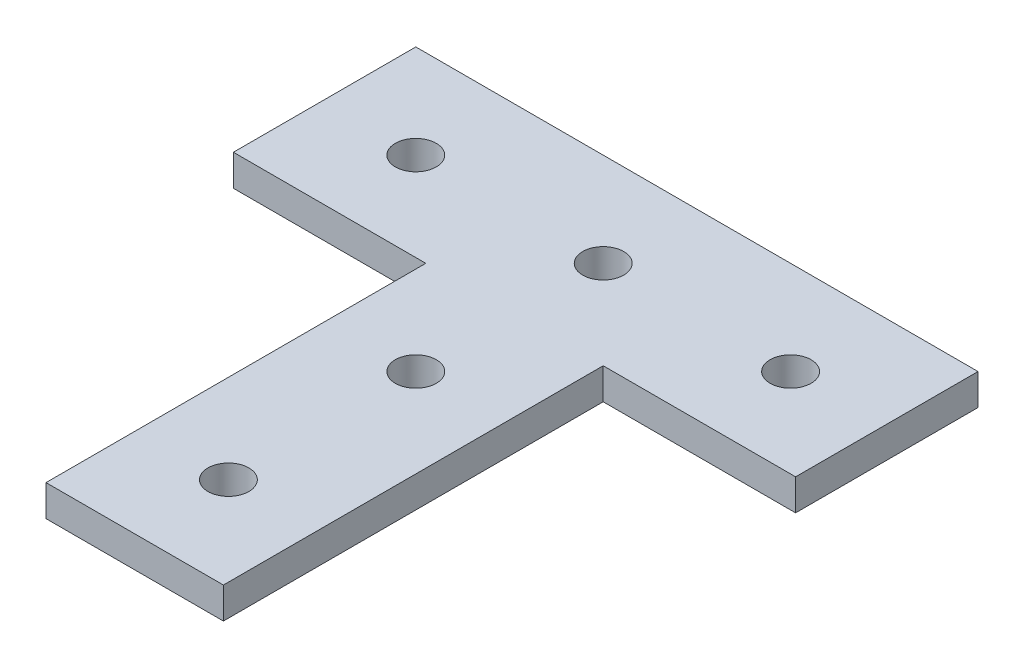
ISO-10303-21;
HEADER;
FILE_DESCRIPTION(('STEP AP214'),'2;1');
FILE_NAME('part.step','',(''),(''),'','','');
FILE_SCHEMA(('AUTOMOTIVE_DESIGN { 1 0 10303 214 1 1 1 1 }'));
ENDSEC;
DATA;
#1=APPLICATION_CONTEXT('core data for automotive mechanical design processes');
#2=APPLICATION_PROTOCOL_DEFINITION('international standard','automotive_design',2000,#1);
#3=PRODUCT_CONTEXT('',#1,'mechanical');
#4=PRODUCT('Part','Part','',(#3));
#5=PRODUCT_RELATED_PRODUCT_CATEGORY('part','',(#4));
#6=PRODUCT_DEFINITION_FORMATION('','',#4);
#7=PRODUCT_DEFINITION_CONTEXT('part definition',#1,'design');
#8=PRODUCT_DEFINITION('design','',#6,#7);
#9=PRODUCT_DEFINITION_SHAPE('','',#8);
#10=(LENGTH_UNIT() NAMED_UNIT(*) SI_UNIT(.MILLI.,.METRE.));
#11=(NAMED_UNIT(*) PLANE_ANGLE_UNIT() SI_UNIT($,.RADIAN.));
#12=(NAMED_UNIT(*) SI_UNIT($,.STERADIAN.) SOLID_ANGLE_UNIT());
#13=UNCERTAINTY_MEASURE_WITH_UNIT(LENGTH_MEASURE(1.E-05),#10,'distance_accuracy_value','');
#14=(GEOMETRIC_REPRESENTATION_CONTEXT(3) GLOBAL_UNCERTAINTY_ASSIGNED_CONTEXT((#13)) GLOBAL_UNIT_ASSIGNED_CONTEXT((#10,
#11,#12)) REPRESENTATION_CONTEXT('',''));
#15=CARTESIAN_POINT('',(0.,0.,0.));
#16=DIRECTION('',(0.,0.,1.));
#17=DIRECTION('',(1.,0.,0.));
#18=AXIS2_PLACEMENT_3D('',#15,#16,#17);
#19=CARTESIAN_POINT('',(75.184,-6.35,114.3));
#20=DIRECTION('',(1.,0.,0.));
#21=DIRECTION('',(0.,0.,-1.));
#22=AXIS2_PLACEMENT_3D('',#19,#20,#21);
#23=PLANE('',#22);
#24=DIRECTION('',(0.,0.,-1.));
#25=VECTOR('',#24,1.);
#26=CARTESIAN_POINT('',(75.1840000254,-6.35,57.15));
#27=LINE('',#26,#25);
#28=CARTESIAN_POINT('',(75.18400000635,-6.35,114.3));
#29=VERTEX_POINT('',#28);
#30=CARTESIAN_POINT('',(75.18400000635,-6.35,37.0839999873));
#31=VERTEX_POINT('',#30);
#32=EDGE_CURVE('E140',#29,#31,#27,.T.);
#33=ORIENTED_EDGE('',*,*,#32,.T.);
#34=DIRECTION('',(0.,-1.,0.));
#35=VECTOR('',#34,1.);
#36=CARTESIAN_POINT('',(75.184,-3.175,37.084));
#37=LINE('',#36,#35);
#38=CARTESIAN_POINT('',(75.18400000635,0.,37.0839999873));
#39=VERTEX_POINT('',#38);
#40=EDGE_CURVE('E120',#39,#31,#37,.T.);
#41=ORIENTED_EDGE('',*,*,#40,.F.);
#42=DIRECTION('',(0.,0.,-1.));
#43=VECTOR('',#42,1.);
#44=CARTESIAN_POINT('',(75.1840000254,0.,57.15));
#45=LINE('',#44,#43);
#46=CARTESIAN_POINT('',(75.18400000635,0.,114.3));
#47=VERTEX_POINT('',#46);
#48=EDGE_CURVE('E107',#47,#39,#45,.T.);
#49=ORIENTED_EDGE('',*,*,#48,.F.);
#50=DIRECTION('',(0.,1.,0.));
#51=VECTOR('',#50,1.);
#52=CARTESIAN_POINT('',(75.184,-3.175,114.3));
#53=LINE('',#52,#51);
#54=EDGE_CURVE('E93',#29,#47,#53,.T.);
#55=ORIENTED_EDGE('',*,*,#54,.F.);
#56=EDGE_LOOP('',(#33,#41,#49,#55));
#57=FACE_BOUND('',#56,.T.);
#58=ADVANCED_FACE('F16',(#57),#23,.T.);
#59=CARTESIAN_POINT('',(75.184,0.,37.084));
#60=DIRECTION('',(0.,0.,1.));
#61=DIRECTION('',(0.,-1.,0.));
#62=AXIS2_PLACEMENT_3D('',#59,#60,#61);
#63=PLANE('',#62);
#64=DIRECTION('',(1.,0.,0.));
#65=VECTOR('',#64,1.);
#66=CARTESIAN_POINT('',(57.15,-6.35,37.0839999492));
#67=LINE('',#66,#65);
#68=CARTESIAN_POINT('',(114.3,-6.35,37.0839999873));
#69=VERTEX_POINT('',#68);
#70=EDGE_CURVE('E171',#31,#69,#67,.T.);
#71=ORIENTED_EDGE('',*,*,#70,.T.);
#72=DIRECTION('',(0.,-1.,0.));
#73=VECTOR('',#72,1.);
#74=CARTESIAN_POINT('',(114.3,-3.175,37.084));
#75=LINE('',#74,#73);
#76=CARTESIAN_POINT('',(114.3,0.,37.0839999873));
#77=VERTEX_POINT('',#76);
#78=EDGE_CURVE('E118',#77,#69,#75,.T.);
#79=ORIENTED_EDGE('',*,*,#78,.F.);
#80=DIRECTION('',(1.,0.,0.));
#81=VECTOR('',#80,1.);
#82=CARTESIAN_POINT('',(57.15,0.,37.0839999492));
#83=LINE('',#82,#81);
#84=EDGE_CURVE('E158',#39,#77,#83,.T.);
#85=ORIENTED_EDGE('',*,*,#84,.F.);
#86=ORIENTED_EDGE('',*,*,#40,.T.);
#87=EDGE_LOOP('',(#71,#79,#85,#86));
#88=FACE_BOUND('',#87,.T.);
#89=ADVANCED_FACE('F169',(#88),#63,.T.);
#90=CARTESIAN_POINT('',(114.3,-6.35,37.084));
#91=DIRECTION('',(1.,0.,0.));
#92=DIRECTION('',(0.,0.,-1.));
#93=AXIS2_PLACEMENT_3D('',#90,#91,#92);
#94=PLANE('',#93);
#95=DIRECTION('',(0.,0.,-1.));
#96=VECTOR('',#95,1.);
#97=CARTESIAN_POINT('',(114.3,-6.35,57.15));
#98=LINE('',#97,#96);
#99=CARTESIAN_POINT('',(114.3,-6.35,0.));
#100=VERTEX_POINT('',#99);
#101=EDGE_CURVE('E330',#69,#100,#98,.T.);
#102=ORIENTED_EDGE('',*,*,#101,.T.);
#103=DIRECTION('',(0.,-1.,0.));
#104=VECTOR('',#103,1.);
#105=CARTESIAN_POINT('',(114.3,-3.175,0.));
#106=LINE('',#105,#104);
#107=CARTESIAN_POINT('',(114.3,0.,0.));
#108=VERTEX_POINT('',#107);
#109=EDGE_CURVE('E116',#108,#100,#106,.T.);
#110=ORIENTED_EDGE('',*,*,#109,.F.);
#111=DIRECTION('',(0.,0.,-1.));
#112=VECTOR('',#111,1.);
#113=CARTESIAN_POINT('',(114.3,0.,57.15));
#114=LINE('',#113,#112);
#115=EDGE_CURVE('E152',#77,#108,#114,.T.);
#116=ORIENTED_EDGE('',*,*,#115,.F.);
#117=ORIENTED_EDGE('',*,*,#78,.T.);
#118=EDGE_LOOP('',(#102,#110,#116,#117));
#119=FACE_BOUND('',#118,.T.);
#120=ADVANCED_FACE('F176',(#119),#94,.T.);
#121=CARTESIAN_POINT('',(114.3,-6.35,0.));
#122=DIRECTION('',(0.,0.,-1.));
#123=DIRECTION('',(-1.,0.,0.));
#124=AXIS2_PLACEMENT_3D('',#121,#122,#123);
#125=PLANE('',#124);
#126=DIRECTION('',(-1.,0.,0.));
#127=VECTOR('',#126,1.);
#128=CARTESIAN_POINT('',(57.15,-6.35,0.));
#129=LINE('',#128,#127);
#130=CARTESIAN_POINT('',(0.,-6.35,0.));
#131=VERTEX_POINT('',#130);
#132=EDGE_CURVE('E183',#100,#131,#129,.T.);
#133=ORIENTED_EDGE('',*,*,#132,.T.);
#134=DIRECTION('',(0.,-1.,0.));
#135=VECTOR('',#134,1.);
#136=CARTESIAN_POINT('',(0.,-3.175,0.));
#137=LINE('',#136,#135);
#138=CARTESIAN_POINT('',(0.,0.,0.));
#139=VERTEX_POINT('',#138);
#140=EDGE_CURVE('E114',#139,#131,#137,.T.);
#141=ORIENTED_EDGE('',*,*,#140,.F.);
#142=DIRECTION('',(-1.,0.,0.));
#143=VECTOR('',#142,1.);
#144=CARTESIAN_POINT('',(57.15,0.,0.));
#145=LINE('',#144,#143);
#146=EDGE_CURVE('E150',#108,#139,#145,.T.);
#147=ORIENTED_EDGE('',*,*,#146,.F.);
#148=ORIENTED_EDGE('',*,*,#109,.T.);
#149=EDGE_LOOP('',(#133,#141,#147,#148));
#150=FACE_BOUND('',#149,.T.);
#151=ADVANCED_FACE('F181',(#150),#125,.T.);
#152=CARTESIAN_POINT('',(0.,-6.35,0.));
#153=DIRECTION('',(-1.,0.,0.));
#154=DIRECTION('',(0.,0.,1.));
#155=AXIS2_PLACEMENT_3D('',#152,#153,#154);
#156=PLANE('',#155);
#157=DIRECTION('',(0.,0.,1.));
#158=VECTOR('',#157,1.);
#159=CARTESIAN_POINT('',(0.,-6.35,57.15));
#160=LINE('',#159,#158);
#161=CARTESIAN_POINT('',(0.,-6.35,37.0839999873));
#162=VERTEX_POINT('',#161);
#163=EDGE_CURVE('E186',#131,#162,#160,.T.);
#164=ORIENTED_EDGE('',*,*,#163,.T.);
#165=DIRECTION('',(0.,-1.,0.));
#166=VECTOR('',#165,1.);
#167=CARTESIAN_POINT('',(0.,-3.175,37.084));
#168=LINE('',#167,#166);
#169=CARTESIAN_POINT('',(0.,0.,37.0839999873));
#170=VERTEX_POINT('',#169);
#171=EDGE_CURVE('E80',#170,#162,#168,.T.);
#172=ORIENTED_EDGE('',*,*,#171,.F.);
#173=DIRECTION('',(0.,0.,1.));
#174=VECTOR('',#173,1.);
#175=CARTESIAN_POINT('',(0.,0.,57.15));
#176=LINE('',#175,#174);
#177=EDGE_CURVE('E91',#139,#170,#176,.T.);
#178=ORIENTED_EDGE('',*,*,#177,.F.);
#179=ORIENTED_EDGE('',*,*,#140,.T.);
#180=EDGE_LOOP('',(#164,#172,#178,#179));
#181=FACE_BOUND('',#180,.T.);
#182=ADVANCED_FACE('F185',(#181),#156,.T.);
#183=CARTESIAN_POINT('',(0.,0.,37.084));
#184=DIRECTION('',(0.,0.,1.));
#185=DIRECTION('',(0.,-1.,0.));
#186=AXIS2_PLACEMENT_3D('',#183,#184,#185);
#187=PLANE('',#186);
#188=DIRECTION('',(1.,0.,0.));
#189=VECTOR('',#188,1.);
#190=CARTESIAN_POINT('',(57.15,-6.35,37.0839999492));
#191=LINE('',#190,#189);
#192=CARTESIAN_POINT('',(39.11599999365,-6.35,37.0839999873));
#193=VERTEX_POINT('',#192);
#194=EDGE_CURVE('E99',#162,#193,#191,.T.);
#195=ORIENTED_EDGE('',*,*,#194,.T.);
#196=DIRECTION('',(0.,-1.,0.));
#197=VECTOR('',#196,1.);
#198=CARTESIAN_POINT('',(39.116,-3.175,37.084));
#199=LINE('',#198,#197);
#200=CARTESIAN_POINT('',(39.11599999365,0.,37.0839999873));
#201=VERTEX_POINT('',#200);
#202=EDGE_CURVE('E96',#201,#193,#199,.T.);
#203=ORIENTED_EDGE('',*,*,#202,.F.);
#204=DIRECTION('',(1.,0.,0.));
#205=VECTOR('',#204,1.);
#206=CARTESIAN_POINT('',(57.15,0.,37.0839999492));
#207=LINE('',#206,#205);
#208=EDGE_CURVE('E85',#170,#201,#207,.T.);
#209=ORIENTED_EDGE('',*,*,#208,.F.);
#210=ORIENTED_EDGE('',*,*,#171,.T.);
#211=EDGE_LOOP('',(#195,#203,#209,#210));
#212=FACE_BOUND('',#211,.T.);
#213=ADVANCED_FACE('F97',(#212),#187,.T.);
#214=CARTESIAN_POINT('',(39.116,0.,37.084));
#215=DIRECTION('',(-1.,0.,0.));
#216=DIRECTION('',(0.,-1.,0.));
#217=AXIS2_PLACEMENT_3D('',#214,#215,#216);
#218=PLANE('',#217);
#219=DIRECTION('',(0.,0.,1.));
#220=VECTOR('',#219,1.);
#221=CARTESIAN_POINT('',(39.1159999746,-6.35,57.15));
#222=LINE('',#221,#220);
#223=CARTESIAN_POINT('',(39.11599999365,-6.35,114.3));
#224=VERTEX_POINT('',#223);
#225=EDGE_CURVE('E323',#193,#224,#222,.T.);
#226=ORIENTED_EDGE('',*,*,#225,.T.);
#227=DIRECTION('',(0.,-1.,0.));
#228=VECTOR('',#227,1.);
#229=CARTESIAN_POINT('',(39.116,-3.175,114.3));
#230=LINE('',#229,#228);
#231=CARTESIAN_POINT('',(39.11599999365,0.,114.3));
#232=VERTEX_POINT('',#231);
#233=EDGE_CURVE('E35',#232,#224,#230,.T.);
#234=ORIENTED_EDGE('',*,*,#233,.F.);
#235=DIRECTION('',(0.,0.,1.));
#236=VECTOR('',#235,1.);
#237=CARTESIAN_POINT('',(39.1159999746,0.,57.15));
#238=LINE('',#237,#236);
#239=EDGE_CURVE('E90',#201,#232,#238,.T.);
#240=ORIENTED_EDGE('',*,*,#239,.F.);
#241=ORIENTED_EDGE('',*,*,#202,.T.);
#242=EDGE_LOOP('',(#226,#234,#240,#241));
#243=FACE_BOUND('',#242,.T.);
#244=ADVANCED_FACE('F104',(#243),#218,.T.);
#245=CARTESIAN_POINT('',(39.116,0.,114.3));
#246=DIRECTION('',(0.,0.,1.));
#247=DIRECTION('',(0.,-1.,0.));
#248=AXIS2_PLACEMENT_3D('',#245,#246,#247);
#249=PLANE('',#248);
#250=DIRECTION('',(1.,0.,0.));
#251=VECTOR('',#250,1.);
#252=CARTESIAN_POINT('',(57.15,-6.35,114.3));
#253=LINE('',#252,#251);
#254=EDGE_CURVE('E136',#224,#29,#253,.T.);
#255=ORIENTED_EDGE('',*,*,#254,.T.);
#256=ORIENTED_EDGE('',*,*,#54,.T.);
#257=DIRECTION('',(1.,0.,0.));
#258=VECTOR('',#257,1.);
#259=CARTESIAN_POINT('',(57.15,0.,114.3));
#260=LINE('',#259,#258);
#261=EDGE_CURVE('E105',#232,#47,#260,.T.);
#262=ORIENTED_EDGE('',*,*,#261,.F.);
#263=ORIENTED_EDGE('',*,*,#233,.T.);
#264=EDGE_LOOP('',(#255,#256,#262,#263));
#265=FACE_BOUND('',#264,.T.);
#266=ADVANCED_FACE('F221',(#265),#249,.T.);
#267=CARTESIAN_POINT('',(57.15,0.,95.25));
#268=DIRECTION('',(0.,-1.,0.));
#269=DIRECTION('',(0.,0.,-1.));
#270=AXIS2_PLACEMENT_3D('',#267,#268,#269);
#271=CYLINDRICAL_SURFACE('',#270,4.16559999999999);
#272=CARTESIAN_POINT('',(57.15,-6.35,95.25));
#273=DIRECTION('',(0.,-1.,0.));
#274=DIRECTION('',(0.,0.,-1.));
#275=AXIS2_PLACEMENT_3D('',#272,#273,#274);
#276=CIRCLE('',#275,4.16559999999999);
#277=CARTESIAN_POINT('',(57.15,-6.35,91.0844));
#278=VERTEX_POINT('',#277);
#279=EDGE_CURVE('E133',#278,#278,#276,.T.);
#280=ORIENTED_EDGE('',*,*,#279,.T.);
#281=EDGE_LOOP('',(#280));
#282=FACE_BOUND('',#281,.T.);
#283=CARTESIAN_POINT('',(57.15,0.,95.25));
#284=DIRECTION('',(0.,-1.,0.));
#285=DIRECTION('',(0.,0.,-1.));
#286=AXIS2_PLACEMENT_3D('',#283,#284,#285);
#287=CIRCLE('',#286,4.16559999999999);
#288=CARTESIAN_POINT('',(57.15,0.,91.0844));
#289=VERTEX_POINT('',#288);
#290=EDGE_CURVE('E20',#289,#289,#287,.T.);
#291=ORIENTED_EDGE('',*,*,#290,.F.);
#292=EDGE_LOOP('',(#291));
#293=FACE_BOUND('',#292,.T.);
#294=ADVANCED_FACE('F217',(#282,#293),#271,.F.);
#295=CARTESIAN_POINT('',(57.15,0.,57.15));
#296=DIRECTION('',(0.,-1.,0.));
#297=DIRECTION('',(0.,0.,-1.));
#298=AXIS2_PLACEMENT_3D('',#295,#296,#297);
#299=CYLINDRICAL_SURFACE('',#298,4.16559999999999);
#300=CARTESIAN_POINT('',(57.15,-6.35,57.15));
#301=DIRECTION('',(0.,-1.,0.));
#302=DIRECTION('',(0.,0.,-1.));
#303=AXIS2_PLACEMENT_3D('',#300,#301,#302);
#304=CIRCLE('',#303,4.16559999999999);
#305=CARTESIAN_POINT('',(57.15,-6.35,52.9844));
#306=VERTEX_POINT('',#305);
#307=EDGE_CURVE('E130',#306,#306,#304,.T.);
#308=ORIENTED_EDGE('',*,*,#307,.T.);
#309=EDGE_LOOP('',(#308));
#310=FACE_BOUND('',#309,.T.);
#311=CARTESIAN_POINT('',(57.15,0.,57.15));
#312=DIRECTION('',(0.,-1.,0.));
#313=DIRECTION('',(0.,0.,-1.));
#314=AXIS2_PLACEMENT_3D('',#311,#312,#313);
#315=CIRCLE('',#314,4.16559999999999);
#316=CARTESIAN_POINT('',(57.15,0.,52.9844));
#317=VERTEX_POINT('',#316);
#318=EDGE_CURVE('E143',#317,#317,#315,.T.);
#319=ORIENTED_EDGE('',*,*,#318,.F.);
#320=EDGE_LOOP('',(#319));
#321=FACE_BOUND('',#320,.T.);
#322=ADVANCED_FACE('F213',(#310,#321),#299,.F.);
#323=CARTESIAN_POINT('',(57.15,0.,19.05));
#324=DIRECTION('',(0.,-1.,0.));
#325=DIRECTION('',(0.,0.,-1.));
#326=AXIS2_PLACEMENT_3D('',#323,#324,#325);
#327=CYLINDRICAL_SURFACE('',#326,4.16559999999999);
#328=CARTESIAN_POINT('',(57.15,-6.35,19.05));
#329=DIRECTION('',(0.,-1.,0.));
#330=DIRECTION('',(0.,0.,-1.));
#331=AXIS2_PLACEMENT_3D('',#328,#329,#330);
#332=CIRCLE('',#331,4.16559999999999);
#333=CARTESIAN_POINT('',(57.15,-6.35,14.8844));
#334=VERTEX_POINT('',#333);
#335=EDGE_CURVE('E127',#334,#334,#332,.T.);
#336=ORIENTED_EDGE('',*,*,#335,.T.);
#337=EDGE_LOOP('',(#336));
#338=FACE_BOUND('',#337,.T.);
#339=CARTESIAN_POINT('',(57.15,0.,19.05));
#340=DIRECTION('',(0.,-1.,0.));
#341=DIRECTION('',(0.,0.,-1.));
#342=AXIS2_PLACEMENT_3D('',#339,#340,#341);
#343=CIRCLE('',#342,4.16559999999999);
#344=CARTESIAN_POINT('',(57.15,0.,14.8844));
#345=VERTEX_POINT('',#344);
#346=EDGE_CURVE('E141',#345,#345,#343,.T.);
#347=ORIENTED_EDGE('',*,*,#346,.F.);
#348=EDGE_LOOP('',(#347));
#349=FACE_BOUND('',#348,.T.);
#350=ADVANCED_FACE('F209',(#338,#349),#327,.F.);
#351=CARTESIAN_POINT('',(95.25,0.,19.05));
#352=DIRECTION('',(0.,-1.,0.));
#353=DIRECTION('',(0.,0.,-1.));
#354=AXIS2_PLACEMENT_3D('',#351,#352,#353);
#355=CYLINDRICAL_SURFACE('',#354,4.16559999999999);
#356=CARTESIAN_POINT('',(95.25,-6.35,19.05));
#357=DIRECTION('',(0.,-1.,0.));
#358=DIRECTION('',(0.,0.,-1.));
#359=AXIS2_PLACEMENT_3D('',#356,#357,#358);
#360=CIRCLE('',#359,4.16559999999999);
#361=CARTESIAN_POINT('',(95.25,-6.35,14.8844));
#362=VERTEX_POINT('',#361);
#363=EDGE_CURVE('E124',#362,#362,#360,.T.);
#364=ORIENTED_EDGE('',*,*,#363,.T.);
#365=EDGE_LOOP('',(#364));
#366=FACE_BOUND('',#365,.T.);
#367=CARTESIAN_POINT('',(95.25,0.,19.05));
#368=DIRECTION('',(0.,-1.,0.));
#369=DIRECTION('',(0.,0.,-1.));
#370=AXIS2_PLACEMENT_3D('',#367,#368,#369);
#371=CIRCLE('',#370,4.16559999999999);
#372=CARTESIAN_POINT('',(95.25,0.,14.8844));
#373=VERTEX_POINT('',#372);
#374=EDGE_CURVE('E137',#373,#373,#371,.T.);
#375=ORIENTED_EDGE('',*,*,#374,.F.);
#376=EDGE_LOOP('',(#375));
#377=FACE_BOUND('',#376,.T.);
#378=ADVANCED_FACE('F206',(#366,#377),#355,.F.);
#379=CARTESIAN_POINT('',(0.,0.,0.));
#380=DIRECTION('',(0.,1.,0.));
#381=DIRECTION('',(0.,0.,1.));
#382=AXIS2_PLACEMENT_3D('',#379,#380,#381);
#383=PLANE('',#382);
#384=ORIENTED_EDGE('',*,*,#374,.T.);
#385=EDGE_LOOP('',(#384));
#386=FACE_BOUND('',#385,.T.);
#387=ORIENTED_EDGE('',*,*,#346,.T.);
#388=EDGE_LOOP('',(#387));
#389=FACE_BOUND('',#388,.T.);
#390=ORIENTED_EDGE('',*,*,#318,.T.);
#391=EDGE_LOOP('',(#390));
#392=FACE_BOUND('',#391,.T.);
#393=ORIENTED_EDGE('',*,*,#290,.T.);
#394=EDGE_LOOP('',(#393));
#395=FACE_BOUND('',#394,.T.);
#396=CARTESIAN_POINT('',(19.05,0.,19.05));
#397=DIRECTION('',(0.,-1.,0.));
#398=DIRECTION('',(0.,0.,-1.));
#399=AXIS2_PLACEMENT_3D('',#396,#397,#398);
#400=CIRCLE('',#399,4.1656);
#401=CARTESIAN_POINT('',(19.05,0.,14.8844));
#402=VERTEX_POINT('',#401);
#403=EDGE_CURVE('E26',#402,#402,#400,.F.);
#404=ORIENTED_EDGE('',*,*,#403,.F.);
#405=EDGE_LOOP('',(#404));
#406=FACE_BOUND('',#405,.T.);
#407=ORIENTED_EDGE('',*,*,#146,.T.);
#408=ORIENTED_EDGE('',*,*,#177,.T.);
#409=ORIENTED_EDGE('',*,*,#208,.T.);
#410=ORIENTED_EDGE('',*,*,#239,.T.);
#411=ORIENTED_EDGE('',*,*,#261,.T.);
#412=ORIENTED_EDGE('',*,*,#48,.T.);
#413=ORIENTED_EDGE('',*,*,#84,.T.);
#414=ORIENTED_EDGE('',*,*,#115,.T.);
#415=EDGE_LOOP('',(#407,#408,#409,#410,#411,#412,#413,#414));
#416=FACE_BOUND('',#415,.T.);
#417=ADVANCED_FACE('F87',(#386,#389,#392,#395,#406,#416),#383,.T.);
#418=CARTESIAN_POINT('',(0.,-6.35,0.));
#419=DIRECTION('',(0.,1.,0.));
#420=DIRECTION('',(0.,0.,1.));
#421=AXIS2_PLACEMENT_3D('',#418,#419,#420);
#422=PLANE('',#421);
#423=ORIENTED_EDGE('',*,*,#363,.F.);
#424=EDGE_LOOP('',(#423));
#425=FACE_BOUND('',#424,.T.);
#426=ORIENTED_EDGE('',*,*,#335,.F.);
#427=EDGE_LOOP('',(#426));
#428=FACE_BOUND('',#427,.T.);
#429=ORIENTED_EDGE('',*,*,#307,.F.);
#430=EDGE_LOOP('',(#429));
#431=FACE_BOUND('',#430,.T.);
#432=ORIENTED_EDGE('',*,*,#279,.F.);
#433=EDGE_LOOP('',(#432));
#434=FACE_BOUND('',#433,.T.);
#435=CARTESIAN_POINT('',(19.05,-6.35,19.05));
#436=DIRECTION('',(0.,-1.,0.));
#437=DIRECTION('',(0.,0.,-1.));
#438=AXIS2_PLACEMENT_3D('',#435,#436,#437);
#439=CIRCLE('',#438,4.1656);
#440=CARTESIAN_POINT('',(19.05,-6.35,14.8844));
#441=VERTEX_POINT('',#440);
#442=EDGE_CURVE('E11',#441,#441,#439,.T.);
#443=ORIENTED_EDGE('',*,*,#442,.F.);
#444=EDGE_LOOP('',(#443));
#445=FACE_BOUND('',#444,.T.);
#446=ORIENTED_EDGE('',*,*,#225,.F.);
#447=ORIENTED_EDGE('',*,*,#194,.F.);
#448=ORIENTED_EDGE('',*,*,#163,.F.);
#449=ORIENTED_EDGE('',*,*,#132,.F.);
#450=ORIENTED_EDGE('',*,*,#101,.F.);
#451=ORIENTED_EDGE('',*,*,#70,.F.);
#452=ORIENTED_EDGE('',*,*,#32,.F.);
#453=ORIENTED_EDGE('',*,*,#254,.F.);
#454=EDGE_LOOP('',(#446,#447,#448,#449,#450,#451,#452,#453));
#455=FACE_BOUND('',#454,.T.);
#456=ADVANCED_FACE('F18',(#425,#428,#431,#434,#445,#455),#422,.F.);
#457=CARTESIAN_POINT('',(19.05,0.,19.05));
#458=DIRECTION('',(0.,-1.,0.));
#459=DIRECTION('',(0.,0.,-1.));
#460=AXIS2_PLACEMENT_3D('',#457,#458,#459);
#461=CYLINDRICAL_SURFACE('',#460,4.1656);
#462=ORIENTED_EDGE('',*,*,#442,.T.);
#463=EDGE_LOOP('',(#462));
#464=FACE_BOUND('',#463,.T.);
#465=ORIENTED_EDGE('',*,*,#403,.T.);
#466=EDGE_LOOP('',(#465));
#467=FACE_BOUND('',#466,.T.);
#468=ADVANCED_FACE('F196',(#464,#467),#461,.F.);
#469=CLOSED_SHELL('',(#58,#89,#120,#151,#182,#213,#244,#266,#294,#322,#350,#378,#417,#456,#468));
#470=MANIFOLD_SOLID_BREP('B1',#469);
#471=ADVANCED_BREP_SHAPE_REPRESENTATION('',(#18,#470),#14);
#472=SHAPE_DEFINITION_REPRESENTATION(#9,#471);
ENDSEC;
END-ISO-10303-21;
